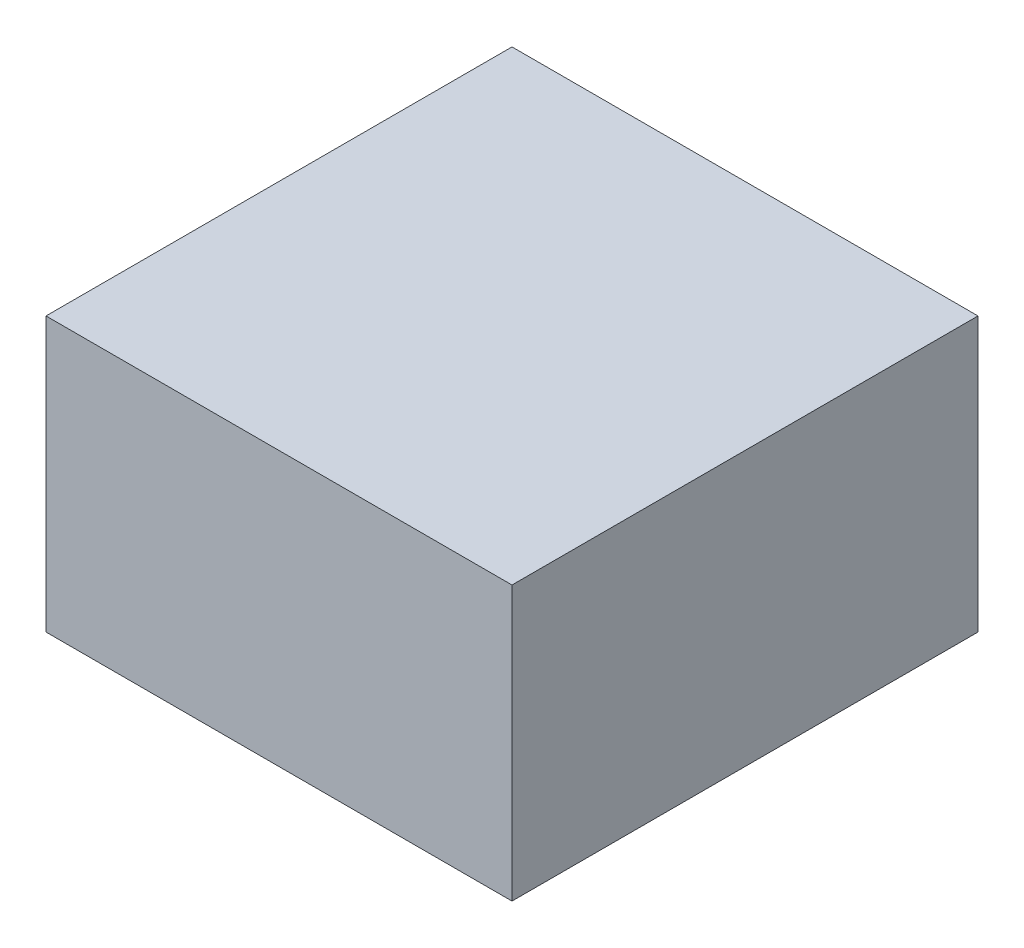
ISO-10303-21;
HEADER;
FILE_DESCRIPTION(('STEP AP214'),'2;1');
FILE_NAME('part.step','',(''),(''),'','','');
FILE_SCHEMA(('AUTOMOTIVE_DESIGN { 1 0 10303 214 1 1 1 1 }'));
ENDSEC;
DATA;
#1=APPLICATION_CONTEXT('core data for automotive mechanical design processes');
#2=APPLICATION_PROTOCOL_DEFINITION('international standard','automotive_design',2000,#1);
#3=PRODUCT_CONTEXT('',#1,'mechanical');
#4=PRODUCT('Part','Part','',(#3));
#5=PRODUCT_RELATED_PRODUCT_CATEGORY('part','',(#4));
#6=PRODUCT_DEFINITION_FORMATION('','',#4);
#7=PRODUCT_DEFINITION_CONTEXT('part definition',#1,'design');
#8=PRODUCT_DEFINITION('design','',#6,#7);
#9=PRODUCT_DEFINITION_SHAPE('','',#8);
#10=(LENGTH_UNIT() NAMED_UNIT(*) SI_UNIT(.MILLI.,.METRE.));
#11=(NAMED_UNIT(*) PLANE_ANGLE_UNIT() SI_UNIT($,.RADIAN.));
#12=(NAMED_UNIT(*) SI_UNIT($,.STERADIAN.) SOLID_ANGLE_UNIT());
#13=UNCERTAINTY_MEASURE_WITH_UNIT(LENGTH_MEASURE(1.E-05),#10,'distance_accuracy_value','');
#14=(GEOMETRIC_REPRESENTATION_CONTEXT(3) GLOBAL_UNCERTAINTY_ASSIGNED_CONTEXT((#13)) GLOBAL_UNIT_ASSIGNED_CONTEXT((#10,
#11,#12)) REPRESENTATION_CONTEXT('',''));
#15=CARTESIAN_POINT('',(0.,0.,0.));
#16=DIRECTION('',(0.,0.,1.));
#17=DIRECTION('',(1.,0.,0.));
#18=AXIS2_PLACEMENT_3D('',#15,#16,#17);
#19=CARTESIAN_POINT('',(-24.,14.1,-24.));
#20=DIRECTION('',(1.,0.,0.));
#21=DIRECTION('',(0.,0.,-1.));
#22=AXIS2_PLACEMENT_3D('',#19,#20,#21);
#23=PLANE('',#22);
#24=DIRECTION('',(0.,0.,1.));
#25=VECTOR('',#24,1.);
#26=CARTESIAN_POINT('',(-24.,-14.1,-24.));
#27=LINE('',#26,#25);
#28=CARTESIAN_POINT('',(-24.,-14.1,-24.));
#29=VERTEX_POINT('',#28);
#30=CARTESIAN_POINT('',(-24.,-14.1,24.));
#31=VERTEX_POINT('',#30);
#32=EDGE_CURVE('E105',#29,#31,#27,.T.);
#33=ORIENTED_EDGE('',*,*,#32,.T.);
#34=DIRECTION('',(0.,-1.,0.));
#35=VECTOR('',#34,1.);
#36=CARTESIAN_POINT('',(-24.,14.1,24.));
#37=LINE('',#36,#35);
#38=CARTESIAN_POINT('',(-24.,14.1,24.));
#39=VERTEX_POINT('',#38);
#40=EDGE_CURVE('E11',#39,#31,#37,.T.);
#41=ORIENTED_EDGE('',*,*,#40,.F.);
#42=DIRECTION('',(0.,0.,1.));
#43=VECTOR('',#42,1.);
#44=CARTESIAN_POINT('',(-24.,14.1,-24.));
#45=LINE('',#44,#43);
#46=CARTESIAN_POINT('',(-24.,14.1,-24.));
#47=VERTEX_POINT('',#46);
#48=EDGE_CURVE('E93',#47,#39,#45,.T.);
#49=ORIENTED_EDGE('',*,*,#48,.F.);
#50=DIRECTION('',(0.,-1.,0.));
#51=VECTOR('',#50,1.);
#52=CARTESIAN_POINT('',(-24.,14.1,-24.));
#53=LINE('',#52,#51);
#54=EDGE_CURVE('E101',#47,#29,#53,.T.);
#55=ORIENTED_EDGE('',*,*,#54,.T.);
#56=EDGE_LOOP('',(#33,#41,#49,#55));
#57=FACE_BOUND('',#56,.T.);
#58=ADVANCED_FACE('F42',(#57),#23,.F.);
#59=CARTESIAN_POINT('',(-24.,14.1,24.));
#60=DIRECTION('',(0.,0.,-1.));
#61=DIRECTION('',(-1.,0.,0.));
#62=AXIS2_PLACEMENT_3D('',#59,#60,#61);
#63=PLANE('',#62);
#64=DIRECTION('',(1.,0.,0.));
#65=VECTOR('',#64,1.);
#66=CARTESIAN_POINT('',(-24.,-14.1,24.));
#67=LINE('',#66,#65);
#68=CARTESIAN_POINT('',(24.,-14.1,24.));
#69=VERTEX_POINT('',#68);
#70=EDGE_CURVE('E97',#31,#69,#67,.T.);
#71=ORIENTED_EDGE('',*,*,#70,.T.);
#72=DIRECTION('',(0.,-1.,0.));
#73=VECTOR('',#72,1.);
#74=CARTESIAN_POINT('',(24.,14.1,24.));
#75=LINE('',#74,#73);
#76=CARTESIAN_POINT('',(24.,14.1,24.));
#77=VERTEX_POINT('',#76);
#78=EDGE_CURVE('E50',#77,#69,#75,.T.);
#79=ORIENTED_EDGE('',*,*,#78,.F.);
#80=DIRECTION('',(1.,0.,0.));
#81=VECTOR('',#80,1.);
#82=CARTESIAN_POINT('',(-24.,14.1,24.));
#83=LINE('',#82,#81);
#84=EDGE_CURVE('E88',#39,#77,#83,.T.);
#85=ORIENTED_EDGE('',*,*,#84,.F.);
#86=ORIENTED_EDGE('',*,*,#40,.T.);
#87=EDGE_LOOP('',(#71,#79,#85,#86));
#88=FACE_BOUND('',#87,.T.);
#89=ADVANCED_FACE('F96',(#88),#63,.F.);
#90=CARTESIAN_POINT('',(24.,14.1,-24.));
#91=DIRECTION('',(-1.,0.,0.));
#92=DIRECTION('',(0.,0.,1.));
#93=AXIS2_PLACEMENT_3D('',#90,#91,#92);
#94=PLANE('',#93);
#95=DIRECTION('',(0.,0.,-1.));
#96=VECTOR('',#95,1.);
#97=CARTESIAN_POINT('',(24.,-14.1,-24.));
#98=LINE('',#97,#96);
#99=CARTESIAN_POINT('',(24.,-14.1,-24.));
#100=VERTEX_POINT('',#99);
#101=EDGE_CURVE('E75',#69,#100,#98,.T.);
#102=ORIENTED_EDGE('',*,*,#101,.T.);
#103=DIRECTION('',(0.,-1.,0.));
#104=VECTOR('',#103,1.);
#105=CARTESIAN_POINT('',(24.,14.1,-24.));
#106=LINE('',#105,#104);
#107=CARTESIAN_POINT('',(24.,14.1,-24.));
#108=VERTEX_POINT('',#107);
#109=EDGE_CURVE('E98',#108,#100,#106,.T.);
#110=ORIENTED_EDGE('',*,*,#109,.F.);
#111=DIRECTION('',(0.,0.,-1.));
#112=VECTOR('',#111,1.);
#113=CARTESIAN_POINT('',(24.,14.1,-24.));
#114=LINE('',#113,#112);
#115=EDGE_CURVE('E91',#77,#108,#114,.T.);
#116=ORIENTED_EDGE('',*,*,#115,.F.);
#117=ORIENTED_EDGE('',*,*,#78,.T.);
#118=EDGE_LOOP('',(#102,#110,#116,#117));
#119=FACE_BOUND('',#118,.T.);
#120=ADVANCED_FACE('F99',(#119),#94,.F.);
#121=CARTESIAN_POINT('',(-24.,14.1,-24.));
#122=DIRECTION('',(0.,0.,1.));
#123=DIRECTION('',(1.,0.,0.));
#124=AXIS2_PLACEMENT_3D('',#121,#122,#123);
#125=PLANE('',#124);
#126=DIRECTION('',(-1.,0.,0.));
#127=VECTOR('',#126,1.);
#128=CARTESIAN_POINT('',(-24.,-14.1,-24.));
#129=LINE('',#128,#127);
#130=EDGE_CURVE('E81',#100,#29,#129,.T.);
#131=ORIENTED_EDGE('',*,*,#130,.T.);
#132=ORIENTED_EDGE('',*,*,#54,.F.);
#133=DIRECTION('',(-1.,0.,0.));
#134=VECTOR('',#133,1.);
#135=CARTESIAN_POINT('',(-24.,14.1,-24.));
#136=LINE('',#135,#134);
#137=EDGE_CURVE('E58',#108,#47,#136,.T.);
#138=ORIENTED_EDGE('',*,*,#137,.F.);
#139=ORIENTED_EDGE('',*,*,#109,.T.);
#140=EDGE_LOOP('',(#131,#132,#138,#139));
#141=FACE_BOUND('',#140,.T.);
#142=ADVANCED_FACE('F112',(#141),#125,.F.);
#143=CARTESIAN_POINT('',(0.,14.1,0.));
#144=DIRECTION('',(0.,1.,0.));
#145=DIRECTION('',(0.,0.,1.));
#146=AXIS2_PLACEMENT_3D('',#143,#144,#145);
#147=PLANE('',#146);
#148=ORIENTED_EDGE('',*,*,#48,.T.);
#149=ORIENTED_EDGE('',*,*,#84,.T.);
#150=ORIENTED_EDGE('',*,*,#115,.T.);
#151=ORIENTED_EDGE('',*,*,#137,.T.);
#152=EDGE_LOOP('',(#148,#149,#150,#151));
#153=FACE_BOUND('',#152,.T.);
#154=ADVANCED_FACE('F89',(#153),#147,.T.);
#155=CARTESIAN_POINT('',(0.,-14.1,0.));
#156=DIRECTION('',(0.,1.,0.));
#157=DIRECTION('',(0.,0.,1.));
#158=AXIS2_PLACEMENT_3D('',#155,#156,#157);
#159=PLANE('',#158);
#160=ORIENTED_EDGE('',*,*,#32,.F.);
#161=ORIENTED_EDGE('',*,*,#130,.F.);
#162=ORIENTED_EDGE('',*,*,#101,.F.);
#163=ORIENTED_EDGE('',*,*,#70,.F.);
#164=EDGE_LOOP('',(#160,#161,#162,#163));
#165=FACE_BOUND('',#164,.T.);
#166=ADVANCED_FACE('F115',(#165),#159,.F.);
#167=CLOSED_SHELL('',(#58,#89,#120,#142,#154,#166));
#168=MANIFOLD_SOLID_BREP('B2',#167);
#169=ADVANCED_BREP_SHAPE_REPRESENTATION('',(#18,#168),#14);
#170=SHAPE_DEFINITION_REPRESENTATION(#9,#169);
ENDSEC;
END-ISO-10303-21;
